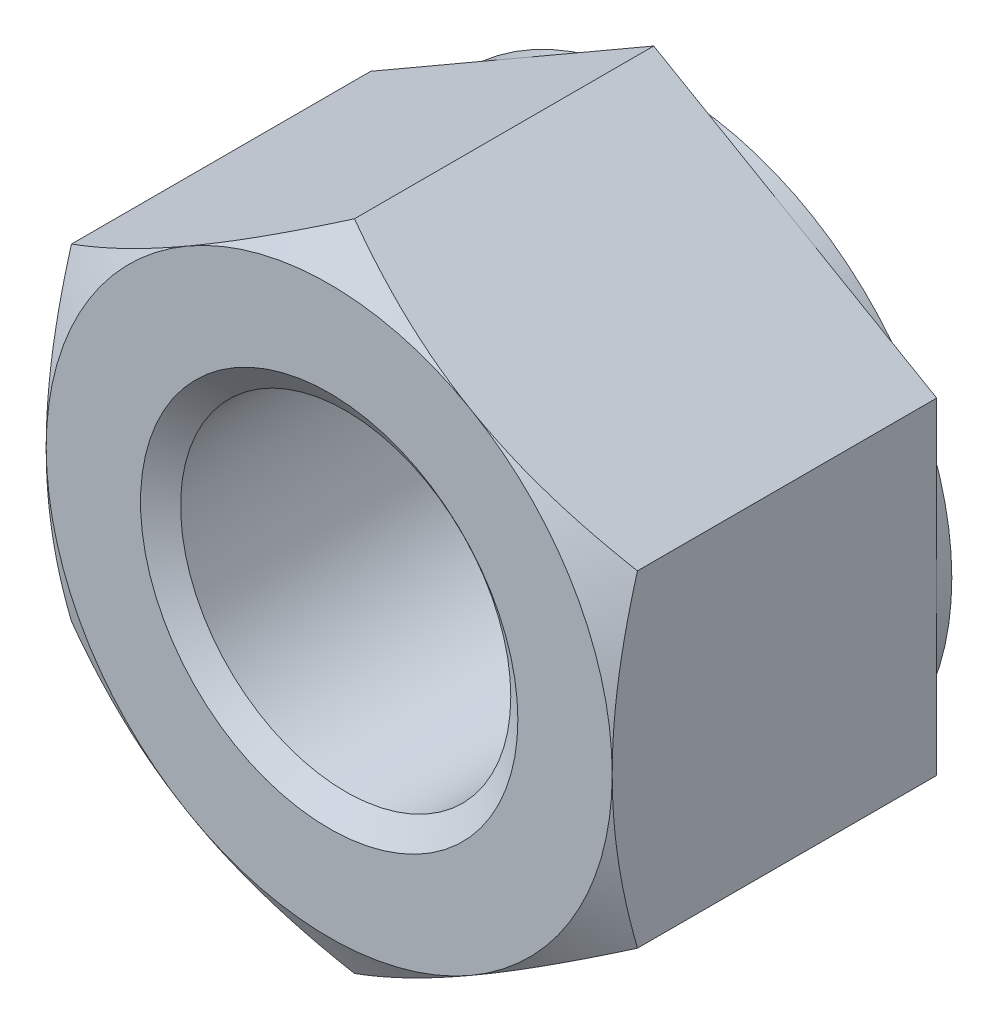
ISO-10303-21;
HEADER;
FILE_DESCRIPTION(('STEP AP214'),'2;1');
FILE_NAME('part.step','',(''),(''),'','','');
FILE_SCHEMA(('AUTOMOTIVE_DESIGN { 1 0 10303 214 1 1 1 1 }'));
ENDSEC;
DATA;
#1=APPLICATION_CONTEXT('core data for automotive mechanical design processes');
#2=APPLICATION_PROTOCOL_DEFINITION('international standard','automotive_design',2000,#1);
#3=PRODUCT_CONTEXT('',#1,'mechanical');
#4=PRODUCT('Part','Part','',(#3));
#5=PRODUCT_RELATED_PRODUCT_CATEGORY('part','',(#4));
#6=PRODUCT_DEFINITION_FORMATION('','',#4);
#7=PRODUCT_DEFINITION_CONTEXT('part definition',#1,'design');
#8=PRODUCT_DEFINITION('design','',#6,#7);
#9=PRODUCT_DEFINITION_SHAPE('','',#8);
#10=(LENGTH_UNIT() NAMED_UNIT(*) SI_UNIT(.MILLI.,.METRE.));
#11=(NAMED_UNIT(*) PLANE_ANGLE_UNIT() SI_UNIT($,.RADIAN.));
#12=(NAMED_UNIT(*) SI_UNIT($,.STERADIAN.) SOLID_ANGLE_UNIT());
#13=UNCERTAINTY_MEASURE_WITH_UNIT(LENGTH_MEASURE(1.E-05),#10,'distance_accuracy_value','');
#14=(GEOMETRIC_REPRESENTATION_CONTEXT(3) GLOBAL_UNCERTAINTY_ASSIGNED_CONTEXT((#13)) GLOBAL_UNIT_ASSIGNED_CONTEXT((#10,
#11,#12)) REPRESENTATION_CONTEXT('',''));
#15=CARTESIAN_POINT('',(0.,0.,0.));
#16=DIRECTION('',(0.,0.,1.));
#17=DIRECTION('',(1.,0.,0.));
#18=AXIS2_PLACEMENT_3D('',#15,#16,#17);
#19=CARTESIAN_POINT('',(0.,0.,-18.));
#20=DIRECTION('',(0.,0.,1.));
#21=DIRECTION('',(1.,0.,0.));
#22=AXIS2_PLACEMENT_3D('',#19,#20,#21);
#23=CYLINDRICAL_SURFACE('',#22,8.75);
#24=CARTESIAN_POINT('',(0.,0.,-0.875259422762141));
#25=DIRECTION('',(0.,0.,1.));
#26=DIRECTION('',(1.,0.,0.));
#27=AXIS2_PLACEMENT_3D('',#24,#25,#26);
#28=CIRCLE('',#27,8.75);
#29=CARTESIAN_POINT('',(8.75,0.,-0.875259422762141));
#30=VERTEX_POINT('',#29);
#31=EDGE_CURVE('E153',#30,#30,#28,.F.);
#32=ORIENTED_EDGE('',*,*,#31,.F.);
#33=EDGE_LOOP('',(#32));
#34=FACE_BOUND('',#33,.T.);
#35=CARTESIAN_POINT('',(0.,0.,-17.0993405772379));
#36=DIRECTION('',(0.,0.,-1.));
#37=DIRECTION('',(-1.,0.,0.));
#38=AXIS2_PLACEMENT_3D('',#35,#36,#37);
#39=CIRCLE('',#38,8.75);
#40=CARTESIAN_POINT('',(-8.75,0.,-17.0993405772379));
#41=VERTEX_POINT('',#40);
#42=EDGE_CURVE('E41',#41,#41,#39,.F.);
#43=ORIENTED_EDGE('',*,*,#42,.F.);
#44=EDGE_LOOP('',(#43));
#45=FACE_BOUND('',#44,.T.);
#46=ADVANCED_FACE('F36',(#34,#45),#23,.F.);
#47=CARTESIAN_POINT('',(-30.,0.,-18.));
#48=DIRECTION('',(0.,0.,1.));
#49=DIRECTION('',(1.,0.,0.));
#50=AXIS2_PLACEMENT_3D('',#47,#48,#49);
#51=PLANE('',#50);
#52=CARTESIAN_POINT('',(0.,0.,-18.));
#53=DIRECTION('',(0.,0.,1.));
#54=DIRECTION('',(1.,0.,0.));
#55=AXIS2_PLACEMENT_3D('',#52,#53,#54);
#56=CIRCLE('',#55,15.);
#57=CARTESIAN_POINT('',(15.,0.,-18.));
#58=VERTEX_POINT('',#57);
#59=EDGE_CURVE('E277',#58,#58,#56,.F.);
#60=ORIENTED_EDGE('',*,*,#59,.T.);
#61=EDGE_LOOP('',(#60));
#62=FACE_BOUND('',#61,.T.);
#63=CARTESIAN_POINT('',(0.,0.,-18.));
#64=DIRECTION('',(0.,0.,1.));
#65=DIRECTION('',(1.,0.,0.));
#66=AXIS2_PLACEMENT_3D('',#63,#64,#65);
#67=CIRCLE('',#66,10.);
#68=CARTESIAN_POINT('',(10.,0.,-18.));
#69=VERTEX_POINT('',#68);
#70=EDGE_CURVE('E297',#69,#69,#67,.F.);
#71=ORIENTED_EDGE('',*,*,#70,.F.);
#72=EDGE_LOOP('',(#71));
#73=FACE_BOUND('',#72,.T.);
#74=ADVANCED_FACE('F229',(#62,#73),#51,.F.);
#75=CARTESIAN_POINT('',(-30.,0.,0.));
#76=DIRECTION('',(0.,0.,1.));
#77=DIRECTION('',(1.,0.,0.));
#78=AXIS2_PLACEMENT_3D('',#75,#76,#77);
#79=PLANE('',#78);
#80=CARTESIAN_POINT('',(0.,0.,0.));
#81=DIRECTION('',(0.,0.,1.));
#82=DIRECTION('',(1.,0.,0.));
#83=AXIS2_PLACEMENT_3D('',#80,#81,#82);
#84=CIRCLE('',#83,15.);
#85=CARTESIAN_POINT('',(15.,0.,0.));
#86=VERTEX_POINT('',#85);
#87=CARTESIAN_POINT('',(7.50000000000002,-12.9903810567666,0.));
#88=VERTEX_POINT('',#87);
#89=EDGE_CURVE('E12',#86,#88,#84,.F.);
#90=ORIENTED_EDGE('',*,*,#89,.F.);
#91=CARTESIAN_POINT('',(0.,0.,0.));
#92=DIRECTION('',(0.,0.,1.));
#93=DIRECTION('',(1.,0.,0.));
#94=AXIS2_PLACEMENT_3D('',#91,#92,#93);
#95=CIRCLE('',#94,15.);
#96=CARTESIAN_POINT('',(7.50000000000002,12.9903810567666,0.));
#97=VERTEX_POINT('',#96);
#98=EDGE_CURVE('E145',#86,#97,#95,.T.);
#99=ORIENTED_EDGE('',*,*,#98,.T.);
#100=CARTESIAN_POINT('',(-7.50000000000002,12.9903810567666,0.));
#101=VERTEX_POINT('',#100);
#102=EDGE_CURVE('E48',#101,#97,#84,.F.);
#103=ORIENTED_EDGE('',*,*,#102,.F.);
#104=CARTESIAN_POINT('',(-15.,0.,0.));
#105=VERTEX_POINT('',#104);
#106=EDGE_CURVE('E358',#105,#101,#84,.F.);
#107=ORIENTED_EDGE('',*,*,#106,.F.);
#108=CARTESIAN_POINT('',(-7.50000000000002,-12.9903810567666,0.));
#109=VERTEX_POINT('',#108);
#110=EDGE_CURVE('E360',#109,#105,#84,.F.);
#111=ORIENTED_EDGE('',*,*,#110,.F.);
#112=EDGE_CURVE('E46',#88,#109,#84,.F.);
#113=ORIENTED_EDGE('',*,*,#112,.F.);
#114=EDGE_LOOP('',(#90,#99,#103,#107,#111,#113));
#115=FACE_BOUND('',#114,.T.);
#116=CARTESIAN_POINT('',(0.,0.,0.));
#117=DIRECTION('',(0.,0.,1.));
#118=DIRECTION('',(1.,0.,0.));
#119=AXIS2_PLACEMENT_3D('',#116,#117,#118);
#120=CIRCLE('',#119,10.);
#121=CARTESIAN_POINT('',(10.,0.,0.));
#122=VERTEX_POINT('',#121);
#123=EDGE_CURVE('E296',#122,#122,#120,.T.);
#124=ORIENTED_EDGE('',*,*,#123,.F.);
#125=EDGE_LOOP('',(#124));
#126=FACE_BOUND('',#125,.T.);
#127=ADVANCED_FACE('F155',(#115,#126),#79,.T.);
#128=CARTESIAN_POINT('',(0.,17.3205080756888,-18.));
#129=DIRECTION('',(-0.500000000000001,0.866025403784438,0.));
#130=DIRECTION('',(-0.866025403784438,-0.500000000000001,0.));
#131=AXIS2_PLACEMENT_3D('',#128,#129,#130);
#132=PLANE('',#131);
#133=DIRECTION('',(0.,0.,1.));
#134=VECTOR('',#133,1.);
#135=CARTESIAN_POINT('',(-15.,8.66025403784437,-18.));
#136=LINE('',#135,#134);
#137=CARTESIAN_POINT('',(-15.,8.66025403784437,-17.2));
#138=VERTEX_POINT('',#137);
#139=CARTESIAN_POINT('',(-15.,8.66025403784437,-1.33974596215562));
#140=VERTEX_POINT('',#139);
#141=EDGE_CURVE('E286',#138,#140,#136,.T.);
#142=ORIENTED_EDGE('',*,*,#141,.T.);
#143=CARTESIAN_POINT('',(-15.0002,8.66013856779054,-1.33981262948894));
#144=CARTESIAN_POINT('',(-14.6705058957662,8.85048754762015,-1.22992178974394));
#145=CARTESIAN_POINT('',(-14.3395258073717,9.04157899075113,-1.12501758932861));
#146=CARTESIAN_POINT('',(-13.674911559644,9.42529420558398,-0.926568581943102));
#147=CARTESIAN_POINT('',(-13.3412765656162,9.61791845919701,-0.833027511049492));
#148=CARTESIAN_POINT('',(-12.6707077197453,10.0050715628708,-0.658562147609859));
#149=CARTESIAN_POINT('',(-12.333767999973,10.199603800782,-0.577667706602186));
#150=CARTESIAN_POINT('',(-11.6575472373606,10.5900200401078,-0.430232643422043));
#151=CARTESIAN_POINT('',(-11.3182663292305,10.7859039637477,-0.363691202381326));
#152=CARTESIAN_POINT('',(-10.6460568576327,11.1740042831265,-0.247792374696308));
#153=CARTESIAN_POINT('',(-10.3131781995737,11.3661918659643,-0.198051383436665));
#154=CARTESIAN_POINT('',(-9.64589556983831,11.7514476718676,-0.114646749003606));
#155=CARTESIAN_POINT('',(-9.31149156892751,11.9445159118115,-0.0809834152900859));
#156=CARTESIAN_POINT('',(-8.64212181582285,12.3309767189539,-0.0305840757080833));
#157=CARTESIAN_POINT('',(-8.30715720719665,12.5243686259132,-0.0138279549580483));
#158=CARTESIAN_POINT('',(-7.636918786609,12.9113309584608,0.00239660617302434));
#159=CARTESIAN_POINT('',(-7.30164498452176,13.1049013783481,0.0018655807275811));
#160=CARTESIAN_POINT('',(-6.6748531126878,13.4667798342773,-0.0152766129981669));
#161=CARTESIAN_POINT('',(-6.38329037496757,13.6351136593857,-0.0297968460490132));
#162=CARTESIAN_POINT('',(-5.80083556199352,13.9713941024471,-0.0716371404224109));
#163=CARTESIAN_POINT('',(-5.50994353564011,14.1393406921673,-0.0989581071094768));
#164=CARTESIAN_POINT('',(-4.92898814775338,14.4747554417509,-0.165923511998906));
#165=CARTESIAN_POINT('',(-4.63892567103482,14.6422230907662,-0.205578128270663));
#166=CARTESIAN_POINT('',(-4.06016058267397,14.9763732703289,-0.296515103017905));
#167=CARTESIAN_POINT('',(-3.77145806484047,15.1430557467157,-0.347798251969261));
#168=CARTESIAN_POINT('',(-2.89508556123959,15.6490296475801,-0.520386864747112));
#169=CARTESIAN_POINT('',(-2.30995340076274,15.9868558579429,-0.658901178256936));
#170=CARTESIAN_POINT('',(-1.14841408999664,16.6574708916881,-0.973271968475219));
#171=CARTESIAN_POINT('',(-0.571992068234585,16.9902683011192,-1.14905461461788));
#172=CARTESIAN_POINT('',(0.000200000000000169,17.3206235457426,-1.33981262948895));
#173=B_SPLINE_CURVE_WITH_KNOTS('',3,(#143,#144,#145,#146,#147,#148,#149,#150,#151,#152,#153,
#154,#155,#156,#157,#158,#159,#160,#161,#162,#163,#164,#165,#166,#167,#168,#169,#170,#171,#172),
.UNSPECIFIED.,.F.,.F.,(4,2,2,2,2,2,2,2,2,2,2,2,2,2,4),(0.,1.18875411504163,2.37789802800057,
3.56980778300395,4.76164951910136,5.92407379683758,7.08652044780812,8.24758247406078,
9.40860862348377,10.4193068498566,11.4300765712312,12.4416826308653,13.4533574773408,
15.5211962051185,17.5849760846241),.UNSPECIFIED.);
#174=EDGE_CURVE('E139',#140,#101,#173,.T.);
#175=ORIENTED_EDGE('',*,*,#174,.T.);
#176=CARTESIAN_POINT('',(0.,17.3205080756888,-1.33974596215562));
#177=VERTEX_POINT('',#176);
#178=EDGE_CURVE('E167',#101,#177,#173,.T.);
#179=ORIENTED_EDGE('',*,*,#178,.T.);
#180=DIRECTION('',(0.,0.,1.));
#181=VECTOR('',#180,1.);
#182=CARTESIAN_POINT('',(0.,17.3205080756888,-18.));
#183=LINE('',#182,#181);
#184=CARTESIAN_POINT('',(0.,17.3205080756888,-17.2));
#185=VERTEX_POINT('',#184);
#186=EDGE_CURVE('E274',#185,#177,#183,.T.);
#187=ORIENTED_EDGE('',*,*,#186,.F.);
#188=DIRECTION('',(-0.866025403784438,-0.500000000000001,0.));
#189=VECTOR('',#188,1.);
#190=CARTESIAN_POINT('',(0.,17.3205080756888,-17.2));
#191=LINE('',#190,#189);
#192=CARTESIAN_POINT('',(-7.50000000000002,12.9903810567666,-17.2));
#193=VERTEX_POINT('',#192);
#194=EDGE_CURVE('E262',#185,#193,#191,.T.);
#195=ORIENTED_EDGE('',*,*,#194,.T.);
#196=EDGE_CURVE('E258',#193,#138,#191,.T.);
#197=ORIENTED_EDGE('',*,*,#196,.T.);
#198=EDGE_LOOP('',(#142,#175,#179,#187,#195,#197));
#199=FACE_BOUND('',#198,.T.);
#200=ADVANCED_FACE('F38',(#199),#132,.T.);
#201=CARTESIAN_POINT('',(15.,8.66025403784437,-18.));
#202=DIRECTION('',(0.500000000000001,0.866025403784438,0.));
#203=DIRECTION('',(-0.866025403784438,0.500000000000001,0.));
#204=AXIS2_PLACEMENT_3D('',#201,#202,#203);
#205=PLANE('',#204);
#206=ORIENTED_EDGE('',*,*,#186,.T.);
#207=CARTESIAN_POINT('',(-0.000200000000000716,17.3206235457426,-1.33981262948895));
#208=CARTESIAN_POINT('',(0.329494104233799,17.130274565913,-1.22992178974395));
#209=CARTESIAN_POINT('',(0.660474192628299,16.939183122782,-1.12501758932862));
#210=CARTESIAN_POINT('',(1.32508844035602,16.5554679079492,-0.926568581943109));
#211=CARTESIAN_POINT('',(1.6587234343838,16.3628436543362,-0.833027511049498));
#212=CARTESIAN_POINT('',(2.32929228025473,15.9756905506624,-0.658562147609865));
#213=CARTESIAN_POINT('',(2.66623200002701,15.7811583127512,-0.577667706602193));
#214=CARTESIAN_POINT('',(3.34245276263938,15.3907420734253,-0.430232643422049));
#215=CARTESIAN_POINT('',(3.68173367076951,15.1948581497855,-0.36369120238133));
#216=CARTESIAN_POINT('',(4.35394314236732,14.8067578304067,-0.247792374696311));
#217=CARTESIAN_POINT('',(4.68682180042634,14.6145702475688,-0.198051383436668));
#218=CARTESIAN_POINT('',(5.3541044301617,14.2293144416656,-0.114646749003608));
#219=CARTESIAN_POINT('',(5.68850843107249,14.0362462017216,-0.0809834152900865));
#220=CARTESIAN_POINT('',(6.35787818417715,13.6497853945792,-0.0305840757080828));
#221=CARTESIAN_POINT('',(6.69284279280335,13.4563934876199,-0.0138279549580478));
#222=CARTESIAN_POINT('',(7.36308121339101,13.0694311550724,0.00239660617302488));
#223=CARTESIAN_POINT('',(7.69835501547825,12.8758607351851,0.00186558072758167));
#224=CARTESIAN_POINT('',(8.32514688731221,12.5139822792559,-0.015276612998165));
#225=CARTESIAN_POINT('',(8.61670962503243,12.3456484541475,-0.0297968460490101));
#226=CARTESIAN_POINT('',(9.19916443800648,12.0093680110861,-0.0716371404224066));
#227=CARTESIAN_POINT('',(9.49005646435989,11.8414214213658,-0.0989581071094725));
#228=CARTESIAN_POINT('',(10.0710118522466,11.5060066717823,-0.165923511998902));
#229=CARTESIAN_POINT('',(10.3610743289652,11.338539022767,-0.205578128270659));
#230=CARTESIAN_POINT('',(10.939839417326,11.0043888432043,-0.296515103017901));
#231=CARTESIAN_POINT('',(11.2285419351595,10.8377063668174,-0.347798251969255));
#232=CARTESIAN_POINT('',(12.1049144387604,10.3317324659531,-0.520386864747105));
#233=CARTESIAN_POINT('',(12.6900465992373,9.99390625559024,-0.658901178256929));
#234=CARTESIAN_POINT('',(13.8515859100034,9.32329122184509,-0.973271968475214));
#235=CARTESIAN_POINT('',(14.4280079317654,8.99049381241394,-1.14905461461788));
#236=CARTESIAN_POINT('',(15.0002,8.66013856779053,-1.33981262948894));
#237=B_SPLINE_CURVE_WITH_KNOTS('',3,(#207,#208,#209,#210,#211,#212,#213,#214,#215,#216,#217,
#218,#219,#220,#221,#222,#223,#224,#225,#226,#227,#228,#229,#230,#231,#232,#233,#234,#235,#236),
.UNSPECIFIED.,.F.,.F.,(4,2,2,2,2,2,2,2,2,2,2,2,2,2,4),(0.,1.18875411504163,2.37789802800057,
3.56980778300395,4.76164951910136,5.92407379683759,7.08652044780812,8.24758247406079,
9.40860862348377,10.4193068498566,11.4300765712312,12.4416826308653,13.4533574773408,
15.5211962051185,17.5849760846241),.UNSPECIFIED.);
#238=EDGE_CURVE('E163',#177,#97,#237,.T.);
#239=ORIENTED_EDGE('',*,*,#238,.T.);
#240=CARTESIAN_POINT('',(15.,8.66025403784441,-1.33974596215562));
#241=VERTEX_POINT('',#240);
#242=EDGE_CURVE('E148',#97,#241,#237,.T.);
#243=ORIENTED_EDGE('',*,*,#242,.T.);
#244=DIRECTION('',(0.,0.,1.));
#245=VECTOR('',#244,1.);
#246=CARTESIAN_POINT('',(15.,8.66025403784437,-18.));
#247=LINE('',#246,#245);
#248=CARTESIAN_POINT('',(15.,8.66025403784437,-17.2));
#249=VERTEX_POINT('',#248);
#250=EDGE_CURVE('E162',#249,#241,#247,.T.);
#251=ORIENTED_EDGE('',*,*,#250,.F.);
#252=DIRECTION('',(-0.866025403784438,0.500000000000001,0.));
#253=VECTOR('',#252,1.);
#254=CARTESIAN_POINT('',(15.,8.66025403784437,-17.2));
#255=LINE('',#254,#253);
#256=CARTESIAN_POINT('',(7.50000000000001,12.9903810567666,-17.2));
#257=VERTEX_POINT('',#256);
#258=EDGE_CURVE('E270',#249,#257,#255,.T.);
#259=ORIENTED_EDGE('',*,*,#258,.T.);
#260=EDGE_CURVE('E266',#257,#185,#255,.T.);
#261=ORIENTED_EDGE('',*,*,#260,.T.);
#262=EDGE_LOOP('',(#206,#239,#243,#251,#259,#261));
#263=FACE_BOUND('',#262,.T.);
#264=ADVANCED_FACE('F242',(#263),#205,.T.);
#265=CARTESIAN_POINT('',(15.,8.66025403784437,-18.));
#266=DIRECTION('',(-1.,0.,0.));
#267=DIRECTION('',(0.,0.,1.));
#268=AXIS2_PLACEMENT_3D('',#265,#266,#267);
#269=PLANE('',#268);
#270=CARTESIAN_POINT('',(15.,-22.9682699623457,-7.17790057965227));
#271=CARTESIAN_POINT('',(15.,-22.6389897831074,-7.01873142404233));
#272=CARTESIAN_POINT('',(15.,-22.3093116021534,-6.86038603901538));
#273=CARTESIAN_POINT('',(15.,-21.6490751536497,-6.54553189598666));
#274=CARTESIAN_POINT('',(15.,-21.3185168764807,-6.38902315816101));
#275=CARTESIAN_POINT('',(15.,-20.3252989549744,-5.92249019185913));
#276=CARTESIAN_POINT('',(15.,-19.6612032697286,-5.61551110607191));
#277=CARTESIAN_POINT('',(15.,-18.3246226043912,-5.00989859467258));
#278=CARTESIAN_POINT('',(15.,-17.6521113636296,-4.71132298088698));
#279=CARTESIAN_POINT('',(15.,-16.3015621477647,-4.12699119584707));
#280=CARTESIAN_POINT('',(15.,-15.6235244629268,-3.84123435637443));
#281=CARTESIAN_POINT('',(15.,-14.2524269634776,-3.28256457383085));
#282=CARTESIAN_POINT('',(15.,-13.5592849190571,-3.00985238384249));
#283=CARTESIAN_POINT('',(15.,-12.1648203164479,-2.48578579805704));
#284=CARTESIAN_POINT('',(15.,-11.4634968579634,-2.23443377846729));
#285=CARTESIAN_POINT('',(15.,-10.0530172161698,-1.75984469264095));
#286=CARTESIAN_POINT('',(15.,-9.34388131081086,-1.53654785403614));
#287=CARTESIAN_POINT('',(15.,-7.91545988349901,-1.12531011422904));
#288=CARTESIAN_POINT('',(15.,-7.19617764885278,-0.937358032225481));
#289=CARTESIAN_POINT('',(15.,-6.10950776052104,-0.68881881982808));
#290=CARTESIAN_POINT('',(15.,-5.74591626101914,-0.611524520059371));
#291=CARTESIAN_POINT('',(15.,-5.01631310495844,-0.469286024803709));
#292=CARTESIAN_POINT('',(15.,-4.65030150125062,-0.404341560532858));
#293=CARTESIAN_POINT('',(15.,-3.91609659669047,-0.287952997760446));
#294=CARTESIAN_POINT('',(15.,-3.54790312013281,-0.236510002059407));
#295=CARTESIAN_POINT('',(15.,-2.80977894214556,-0.148161213469115));
#296=CARTESIAN_POINT('',(15.,-2.43984831081849,-0.111254838973176));
#297=CARTESIAN_POINT('',(15.,-1.70111543119015,-0.0529692351511495));
#298=CARTESIAN_POINT('',(15.,-1.3323208752846,-0.0314931455080655));
#299=CARTESIAN_POINT('',(15.,-0.594154033471582,-0.00418216853329556));
#300=CARTESIAN_POINT('',(15.,-0.224781755128986,0.00165292191908621));
#301=CARTESIAN_POINT('',(15.,0.513772761739784,-0.00245653426590893));
#302=CARTESIAN_POINT('',(15.,0.882955024506784,-0.0123966523921697));
#303=CARTESIAN_POINT('',(15.,1.62057875039961,-0.0478095011464145));
#304=CARTESIAN_POINT('',(15.,1.98902017560892,-0.0732830074530984));
#305=CARTESIAN_POINT('',(15.,2.8820087859798,-0.153315988744048));
#306=CARTESIAN_POINT('',(15.,3.40586988037196,-0.215658229469292));
#307=CARTESIAN_POINT('',(15.,4.44957771463113,-0.368284321561815));
#308=CARTESIAN_POINT('',(15.,4.96942331940065,-0.458575797224096));
#309=CARTESIAN_POINT('',(15.,6.00467140043031,-0.663898119259711));
#310=CARTESIAN_POINT('',(15.,6.52006919294574,-0.778952357645808));
#311=CARTESIAN_POINT('',(15.,7.54556200724785,-1.030289356594));
#312=CARTESIAN_POINT('',(15.,8.0556575236537,-1.1665701177488));
#313=CARTESIAN_POINT('',(15.,9.08310964327574,-1.46066370490327));
#314=CARTESIAN_POINT('',(15.,9.60033774272843,-1.61892244443969));
#315=CARTESIAN_POINT('',(15.,10.6293258234342,-1.95107200986663));
#316=CARTESIAN_POINT('',(15.,11.1410893076101,-2.12495205365791));
#317=CARTESIAN_POINT('',(15.,12.1570993841288,-2.48477464183465));
#318=CARTESIAN_POINT('',(15.,12.6613720729254,-2.67064378150476));
#319=CARTESIAN_POINT('',(15.,13.4147912594165,-2.95756327132974));
#320=CARTESIAN_POINT('',(15.,13.6654863245841,-3.05457748949892));
#321=CARTESIAN_POINT('',(15.,14.1659013187592,-3.2510732293356));
#322=CARTESIAN_POINT('',(15.,14.4156212703266,-3.35055469352571));
#323=CARTESIAN_POINT('',(15.,14.6648887120004,-3.45115877453161));
#324=B_SPLINE_CURVE_WITH_KNOTS('',3,(#270,#271,#272,#273,#274,#275,#276,#277,#278,#279,#280,
#281,#282,#283,#284,#285,#286,#287,#288,#289,#290,#291,#292,#293,#294,#295,#296,#297,#298,#299,
#300,#301,#302,#303,#304,#305,#306,#307,#308,#309,#310,#311,#312,#313,#314,#315,#316,#317,#318,
#319,#320,#321,#322,#323),.UNSPECIFIED.,.F.,.F.,(4,2,2,2,2,2,2,2,2,2,2,2,2,2,2,2,2,2,2,2,2,2,2,
2,2,2,4),(0.,1.09719534304745,2.19440272785255,4.38917437060373,6.59650580508102,
8.80372204153741,11.0380360432621,13.2725982762572,15.502315932016,17.7313270580364,
18.8463006788364,19.9612500303848,21.0762904227212,22.1912861980293,23.2992201789375,
24.4071397716721,25.5147483975893,26.6224123378252,28.2042036031028,29.7864267473646,
31.3701511423085,32.9537264503146,34.5761185954281,36.1973994161361,37.8095545791833,
38.615979427752,39.4223855073193),.UNSPECIFIED.);
#325=CARTESIAN_POINT('',(15.,-8.66025403784442,-1.33974596215562));
#326=VERTEX_POINT('',#325);
#327=EDGE_CURVE('E128',#326,#86,#324,.T.);
#328=ORIENTED_EDGE('',*,*,#327,.F.);
#329=DIRECTION('',(0.,0.,1.));
#330=VECTOR('',#329,1.);
#331=CARTESIAN_POINT('',(15.,-8.66025403784441,-18.));
#332=LINE('',#331,#330);
#333=CARTESIAN_POINT('',(15.,-8.66025403784441,-17.2));
#334=VERTEX_POINT('',#333);
#335=EDGE_CURVE('E279',#334,#326,#332,.T.);
#336=ORIENTED_EDGE('',*,*,#335,.F.);
#337=DIRECTION('',(0.,-1.,0.));
#338=VECTOR('',#337,1.);
#339=CARTESIAN_POINT('',(15.,8.66025403784437,-17.2));
#340=LINE('',#339,#338);
#341=CARTESIAN_POINT('',(15.,0.,-17.2));
#342=VERTEX_POINT('',#341);
#343=EDGE_CURVE('E271',#342,#334,#340,.T.);
#344=ORIENTED_EDGE('',*,*,#343,.F.);
#345=EDGE_CURVE('E273',#249,#342,#340,.T.);
#346=ORIENTED_EDGE('',*,*,#345,.F.);
#347=ORIENTED_EDGE('',*,*,#250,.T.);
#348=EDGE_CURVE('E141',#86,#241,#324,.T.);
#349=ORIENTED_EDGE('',*,*,#348,.F.);
#350=EDGE_LOOP('',(#328,#336,#344,#346,#347,#349));
#351=FACE_BOUND('',#350,.T.);
#352=ADVANCED_FACE('F159',(#351),#269,.F.);
#353=CARTESIAN_POINT('',(0.,-17.3205080756888,-18.));
#354=DIRECTION('',(0.500000000000001,-0.866025403784438,0.));
#355=DIRECTION('',(0.866025403784438,0.500000000000001,0.));
#356=AXIS2_PLACEMENT_3D('',#353,#354,#355);
#357=PLANE('',#356);
#358=ORIENTED_EDGE('',*,*,#335,.T.);
#359=CARTESIAN_POINT('',(15.0002,-8.66013856779057,-1.33981262948895));
#360=CARTESIAN_POINT('',(14.6705058957662,-8.85048754762019,-1.22992178974395));
#361=CARTESIAN_POINT('',(14.3395258073717,-9.04157899075116,-1.12501758932862));
#362=CARTESIAN_POINT('',(13.674911559644,-9.42529420558402,-0.926568581943113));
#363=CARTESIAN_POINT('',(13.3412765656162,-9.61791845919704,-0.833027511049504));
#364=CARTESIAN_POINT('',(12.6707077197453,-10.0050715628708,-0.658562147609871));
#365=CARTESIAN_POINT('',(12.333767999973,-10.199603800782,-0.577667706602198));
#366=CARTESIAN_POINT('',(11.6575472373606,-10.5900200401079,-0.430232643422054));
#367=CARTESIAN_POINT('',(11.3182663292305,-10.7859039637477,-0.363691202381338));
#368=CARTESIAN_POINT('',(10.6460568576327,-11.1740042831265,-0.247792374696322));
#369=CARTESIAN_POINT('',(10.3131781995737,-11.3661918659644,-0.198051383436679));
#370=CARTESIAN_POINT('',(9.6458955698383,-11.7514476718676,-0.114646749003621));
#371=CARTESIAN_POINT('',(9.3114915689275,-11.9445159118116,-0.080983415290101));
#372=CARTESIAN_POINT('',(8.64212181582284,-12.330976718954,-0.0305840757080993));
#373=CARTESIAN_POINT('',(8.30715720719664,-12.5243686259133,-0.0138279549580646));
#374=CARTESIAN_POINT('',(7.63691878660899,-12.9113309584608,0.00239660617300668));
#375=CARTESIAN_POINT('',(7.30164498452175,-13.1049013783481,0.00186558072756239));
#376=CARTESIAN_POINT('',(6.67485311268779,-13.4667798342773,-0.0152766129981866));
#377=CARTESIAN_POINT('',(6.38329037496757,-13.6351136593857,-0.029796846049033));
#378=CARTESIAN_POINT('',(5.80083556199351,-13.9713941024471,-0.0716371404224307));
#379=CARTESIAN_POINT('',(5.5099435356401,-14.1393406921674,-0.0989581071094967));
#380=CARTESIAN_POINT('',(4.92898814775337,-14.4747554417509,-0.165923511998927));
#381=CARTESIAN_POINT('',(4.63892567103481,-14.6422230907662,-0.205578128270684));
#382=CARTESIAN_POINT('',(4.06016058267396,-14.9763732703289,-0.296515103017927));
#383=CARTESIAN_POINT('',(3.77145806484046,-15.1430557467158,-0.347798251969283));
#384=CARTESIAN_POINT('',(2.89508556123959,-15.6490296475801,-0.520386864747134));
#385=CARTESIAN_POINT('',(2.30995340076274,-15.986855857943,-0.658901178256957));
#386=CARTESIAN_POINT('',(1.14841408999663,-16.6574708916881,-0.973271968475242));
#387=CARTESIAN_POINT('',(0.571992068234582,-16.9902683011193,-1.14905461461791));
#388=CARTESIAN_POINT('',(-0.000200000000001088,-17.3206235457427,-1.33981262948897));
#389=B_SPLINE_CURVE_WITH_KNOTS('',3,(#359,#360,#361,#362,#363,#364,#365,#366,#367,#368,#369,
#370,#371,#372,#373,#374,#375,#376,#377,#378,#379,#380,#381,#382,#383,#384,#385,#386,#387,#388),
.UNSPECIFIED.,.F.,.F.,(4,2,2,2,2,2,2,2,2,2,2,2,2,2,4),(0.,1.18875411504163,2.37789802800057,
3.56980778300395,4.76164951910137,5.92407379683759,7.08652044780813,8.24758247406079,
9.40860862348378,10.4193068498566,11.4300765712312,12.4416826308653,13.4533574773408,
15.5211962051185,17.5849760846241),.UNSPECIFIED.);
#390=EDGE_CURVE('E134',#326,#88,#389,.T.);
#391=ORIENTED_EDGE('',*,*,#390,.T.);
#392=CARTESIAN_POINT('',(0.,-17.3205080756888,-1.33974596215562));
#393=VERTEX_POINT('',#392);
#394=EDGE_CURVE('E55',#88,#393,#389,.T.);
#395=ORIENTED_EDGE('',*,*,#394,.T.);
#396=DIRECTION('',(0.,0.,1.));
#397=VECTOR('',#396,1.);
#398=CARTESIAN_POINT('',(0.,-17.3205080756888,-18.));
#399=LINE('',#398,#397);
#400=CARTESIAN_POINT('',(0.,-17.3205080756888,-17.2));
#401=VERTEX_POINT('',#400);
#402=EDGE_CURVE('E281',#401,#393,#399,.T.);
#403=ORIENTED_EDGE('',*,*,#402,.F.);
#404=DIRECTION('',(0.866025403784438,0.500000000000001,0.));
#405=VECTOR('',#404,1.);
#406=CARTESIAN_POINT('',(0.,-17.3205080756888,-17.2));
#407=LINE('',#406,#405);
#408=CARTESIAN_POINT('',(7.50000000000004,-12.9903810567666,-17.2));
#409=VERTEX_POINT('',#408);
#410=EDGE_CURVE('E263',#401,#409,#407,.T.);
#411=ORIENTED_EDGE('',*,*,#410,.T.);
#412=EDGE_CURVE('E267',#409,#334,#407,.T.);
#413=ORIENTED_EDGE('',*,*,#412,.T.);
#414=EDGE_LOOP('',(#358,#391,#395,#403,#411,#413));
#415=FACE_BOUND('',#414,.T.);
#416=ADVANCED_FACE('F215',(#415),#357,.T.);
#417=CARTESIAN_POINT('',(-15.,-8.66025403784441,-18.));
#418=DIRECTION('',(-0.500000000000001,-0.866025403784438,0.));
#419=DIRECTION('',(0.866025403784438,-0.500000000000001,0.));
#420=AXIS2_PLACEMENT_3D('',#417,#418,#419);
#421=PLANE('',#420);
#422=ORIENTED_EDGE('',*,*,#402,.T.);
#423=CARTESIAN_POINT('',(0.0002,-17.3206235457427,-1.33981262948897));
#424=CARTESIAN_POINT('',(-0.329494104233801,-17.130274565913,-1.22992178974397));
#425=CARTESIAN_POINT('',(-0.660474192628302,-16.9391831227821,-1.12501758932864));
#426=CARTESIAN_POINT('',(-1.32508844035602,-16.5554679079492,-0.926568581943131));
#427=CARTESIAN_POINT('',(-1.65872343438381,-16.3628436543362,-0.833027511049521));
#428=CARTESIAN_POINT('',(-2.32929228025473,-15.9756905506624,-0.658562147609886));
#429=CARTESIAN_POINT('',(-2.66623200002702,-15.7811583127512,-0.577667706602212));
#430=CARTESIAN_POINT('',(-3.34245276263939,-15.3907420734254,-0.430232643422067));
#431=CARTESIAN_POINT('',(-3.68173367076952,-15.1948581497855,-0.36369120238135));
#432=CARTESIAN_POINT('',(-4.35394314236733,-14.8067578304067,-0.247792374696331));
#433=CARTESIAN_POINT('',(-4.68682180042635,-14.6145702475689,-0.198051383436687));
#434=CARTESIAN_POINT('',(-5.35410443016171,-14.2293144416656,-0.114646749003627));
#435=CARTESIAN_POINT('',(-5.68850843107251,-14.0362462017216,-0.080983415290106));
#436=CARTESIAN_POINT('',(-6.35787818417717,-13.6497853945793,-0.0305840757081023));
#437=CARTESIAN_POINT('',(-6.69284279280337,-13.4563934876199,-0.0138279549580668));
#438=CARTESIAN_POINT('',(-7.36308121339103,-13.0694311550724,0.00239660617300584));
#439=CARTESIAN_POINT('',(-7.69835501547827,-12.8758607351851,0.0018655807275622));
#440=CARTESIAN_POINT('',(-8.32514688731223,-12.5139822792559,-0.0152766129981846));
#441=CARTESIAN_POINT('',(-8.61670962503245,-12.3456484541475,-0.0297968460490295));
#442=CARTESIAN_POINT('',(-9.1991644380065,-12.0093680110861,-0.0716371404224256));
#443=CARTESIAN_POINT('',(-9.49005646435991,-11.8414214213659,-0.0989581071094914));
#444=CARTESIAN_POINT('',(-10.0710118522466,-11.5060066717823,-0.16592351199892));
#445=CARTESIAN_POINT('',(-10.3610743289652,-11.338539022767,-0.205578128270677));
#446=CARTESIAN_POINT('',(-10.939839417326,-11.0043888432043,-0.296515103017917));
#447=CARTESIAN_POINT('',(-11.2285419351595,-10.8377063668174,-0.347798251969272));
#448=CARTESIAN_POINT('',(-12.1049144387604,-10.3317324659531,-0.52038686474712));
#449=CARTESIAN_POINT('',(-12.6900465992373,-9.99390625559027,-0.658901178256943));
#450=CARTESIAN_POINT('',(-13.8515859100034,-9.32329122184512,-0.973271968475224));
#451=CARTESIAN_POINT('',(-14.4280079317654,-8.99049381241398,-1.14905461461789));
#452=CARTESIAN_POINT('',(-15.0002,-8.66013856779057,-1.33981262948895));
#453=B_SPLINE_CURVE_WITH_KNOTS('',3,(#423,#424,#425,#426,#427,#428,#429,#430,#431,#432,#433,
#434,#435,#436,#437,#438,#439,#440,#441,#442,#443,#444,#445,#446,#447,#448,#449,#450,#451,#452),
.UNSPECIFIED.,.F.,.F.,(4,2,2,2,2,2,2,2,2,2,2,2,2,2,4),(0.,1.18875411504163,2.37789802800058,
3.56980778300396,4.76164951910137,5.92407379683761,7.08652044780814,8.24758247406081,
9.4086086234838,10.4193068498567,11.4300765712312,12.4416826308653,13.4533574773408,
15.5211962051185,17.5849760846241),.UNSPECIFIED.);
#454=EDGE_CURVE('E209',#393,#109,#453,.T.);
#455=ORIENTED_EDGE('',*,*,#454,.T.);
#456=CARTESIAN_POINT('',(-15.,-8.66025403784441,-1.33974596215562));
#457=VERTEX_POINT('',#456);
#458=EDGE_CURVE('E62',#109,#457,#453,.T.);
#459=ORIENTED_EDGE('',*,*,#458,.T.);
#460=DIRECTION('',(0.,0.,1.));
#461=VECTOR('',#460,1.);
#462=CARTESIAN_POINT('',(-15.,-8.66025403784441,-18.));
#463=LINE('',#462,#461);
#464=CARTESIAN_POINT('',(-15.,-8.66025403784441,-17.2));
#465=VERTEX_POINT('',#464);
#466=EDGE_CURVE('E284',#465,#457,#463,.T.);
#467=ORIENTED_EDGE('',*,*,#466,.F.);
#468=DIRECTION('',(0.866025403784438,-0.500000000000001,0.));
#469=VECTOR('',#468,1.);
#470=CARTESIAN_POINT('',(-15.,-8.66025403784441,-17.2));
#471=LINE('',#470,#469);
#472=CARTESIAN_POINT('',(-7.50000000000004,-12.9903810567666,-17.2));
#473=VERTEX_POINT('',#472);
#474=EDGE_CURVE('E253',#465,#473,#471,.T.);
#475=ORIENTED_EDGE('',*,*,#474,.T.);
#476=EDGE_CURVE('E259',#473,#401,#471,.T.);
#477=ORIENTED_EDGE('',*,*,#476,.T.);
#478=EDGE_LOOP('',(#422,#455,#459,#467,#475,#477));
#479=FACE_BOUND('',#478,.T.);
#480=ADVANCED_FACE('F211',(#479),#421,.T.);
#481=CARTESIAN_POINT('',(-15.,8.66025403784437,-18.));
#482=DIRECTION('',(-1.,0.,0.));
#483=DIRECTION('',(0.,0.,1.));
#484=AXIS2_PLACEMENT_3D('',#481,#482,#483);
#485=PLANE('',#484);
#486=ORIENTED_EDGE('',*,*,#466,.T.);
#487=CARTESIAN_POINT('',(-15.,-22.9682699623457,-7.17790057965227));
#488=CARTESIAN_POINT('',(-15.,-22.6389897831074,-7.01873142404233));
#489=CARTESIAN_POINT('',(-15.,-22.3093116021534,-6.86038603901538));
#490=CARTESIAN_POINT('',(-15.,-21.6490751536497,-6.54553189598666));
#491=CARTESIAN_POINT('',(-15.,-21.3185168764807,-6.38902315816101));
#492=CARTESIAN_POINT('',(-15.,-20.3252989549744,-5.92249019185913));
#493=CARTESIAN_POINT('',(-15.,-19.6612032697286,-5.61551110607191));
#494=CARTESIAN_POINT('',(-15.,-18.3246226043912,-5.00989859467258));
#495=CARTESIAN_POINT('',(-15.,-17.6521113636296,-4.71132298088698));
#496=CARTESIAN_POINT('',(-15.,-16.3015621477647,-4.12699119584707));
#497=CARTESIAN_POINT('',(-15.,-15.6235244629268,-3.84123435637443));
#498=CARTESIAN_POINT('',(-15.,-14.2524269634776,-3.28256457383085));
#499=CARTESIAN_POINT('',(-15.,-13.5592849190571,-3.00985238384249));
#500=CARTESIAN_POINT('',(-15.,-12.1648203164479,-2.48578579805704));
#501=CARTESIAN_POINT('',(-15.,-11.4634968579634,-2.23443377846729));
#502=CARTESIAN_POINT('',(-15.,-10.0530172161698,-1.75984469264095));
#503=CARTESIAN_POINT('',(-15.,-9.34388131081086,-1.53654785403614));
#504=CARTESIAN_POINT('',(-15.,-7.91545988349901,-1.12531011422904));
#505=CARTESIAN_POINT('',(-15.,-7.19617764885278,-0.937358032225481));
#506=CARTESIAN_POINT('',(-15.,-6.10950776052104,-0.68881881982808));
#507=CARTESIAN_POINT('',(-15.,-5.74591626101914,-0.611524520059371));
#508=CARTESIAN_POINT('',(-15.,-5.01631310495844,-0.469286024803709));
#509=CARTESIAN_POINT('',(-15.,-4.65030150125062,-0.404341560532858));
#510=CARTESIAN_POINT('',(-15.,-3.91609659669047,-0.287952997760446));
#511=CARTESIAN_POINT('',(-15.,-3.54790312013281,-0.236510002059407));
#512=CARTESIAN_POINT('',(-15.,-2.80977894214556,-0.148161213469115));
#513=CARTESIAN_POINT('',(-15.,-2.43984831081849,-0.111254838973176));
#514=CARTESIAN_POINT('',(-15.,-1.70111543119015,-0.0529692351511495));
#515=CARTESIAN_POINT('',(-15.,-1.3323208752846,-0.0314931455080655));
#516=CARTESIAN_POINT('',(-15.,-0.594154033471582,-0.00418216853329556));
#517=CARTESIAN_POINT('',(-15.,-0.224781755128986,0.00165292191908621));
#518=CARTESIAN_POINT('',(-15.,0.513772761739784,-0.00245653426590893));
#519=CARTESIAN_POINT('',(-15.,0.882955024506784,-0.0123966523921697));
#520=CARTESIAN_POINT('',(-15.,1.62057875039961,-0.0478095011464145));
#521=CARTESIAN_POINT('',(-15.,1.98902017560892,-0.0732830074530984));
#522=CARTESIAN_POINT('',(-15.,2.8820087859798,-0.153315988744048));
#523=CARTESIAN_POINT('',(-15.,3.40586988037196,-0.215658229469292));
#524=CARTESIAN_POINT('',(-15.,4.44957771463113,-0.368284321561815));
#525=CARTESIAN_POINT('',(-15.,4.96942331940065,-0.458575797224096));
#526=CARTESIAN_POINT('',(-15.,6.00467140043031,-0.663898119259711));
#527=CARTESIAN_POINT('',(-15.,6.52006919294574,-0.778952357645808));
#528=CARTESIAN_POINT('',(-15.,7.54556200724785,-1.030289356594));
#529=CARTESIAN_POINT('',(-15.,8.0556575236537,-1.1665701177488));
#530=CARTESIAN_POINT('',(-15.,9.08310964327574,-1.46066370490327));
#531=CARTESIAN_POINT('',(-15.,9.60033774272843,-1.61892244443969));
#532=CARTESIAN_POINT('',(-15.,10.6293258234342,-1.95107200986663));
#533=CARTESIAN_POINT('',(-15.,11.1410893076101,-2.12495205365791));
#534=CARTESIAN_POINT('',(-15.,12.1570993841288,-2.48477464183465));
#535=CARTESIAN_POINT('',(-15.,12.6613720729254,-2.67064378150476));
#536=CARTESIAN_POINT('',(-15.,13.4147912594165,-2.95756327132974));
#537=CARTESIAN_POINT('',(-15.,13.6654863245841,-3.05457748949892));
#538=CARTESIAN_POINT('',(-15.,14.1659013187592,-3.2510732293356));
#539=CARTESIAN_POINT('',(-15.,14.4156212703266,-3.35055469352571));
#540=CARTESIAN_POINT('',(-15.,14.6648887120004,-3.45115877453161));
#541=B_SPLINE_CURVE_WITH_KNOTS('',3,(#487,#488,#489,#490,#491,#492,#493,#494,#495,#496,#497,
#498,#499,#500,#501,#502,#503,#504,#505,#506,#507,#508,#509,#510,#511,#512,#513,#514,#515,#516,
#517,#518,#519,#520,#521,#522,#523,#524,#525,#526,#527,#528,#529,#530,#531,#532,#533,#534,#535,
#536,#537,#538,#539,#540),.UNSPECIFIED.,.F.,.F.,(4,2,2,2,2,2,2,2,2,2,2,2,2,2,2,2,2,2,2,2,2,2,2,
2,2,2,4),(0.,1.09719534304745,2.19440272785255,4.38917437060373,6.59650580508102,
8.80372204153741,11.0380360432621,13.2725982762572,15.502315932016,17.7313270580364,
18.8463006788364,19.9612500303848,21.0762904227212,22.1912861980293,23.2992201789375,
24.4071397716721,25.5147483975893,26.6224123378252,28.2042036031028,29.7864267473646,
31.3701511423085,32.9537264503146,34.5761185954281,36.1973994161361,37.8095545791833,
38.615979427752,39.4223855073193),.UNSPECIFIED.);
#542=EDGE_CURVE('E210',#457,#105,#541,.T.);
#543=ORIENTED_EDGE('',*,*,#542,.T.);
#544=EDGE_CURVE('E152',#105,#140,#541,.T.);
#545=ORIENTED_EDGE('',*,*,#544,.T.);
#546=ORIENTED_EDGE('',*,*,#141,.F.);
#547=DIRECTION('',(0.,-1.,0.));
#548=VECTOR('',#547,1.);
#549=CARTESIAN_POINT('',(-15.,8.66025403784437,-17.2));
#550=LINE('',#549,#548);
#551=CARTESIAN_POINT('',(-15.,0.,-17.2));
#552=VERTEX_POINT('',#551);
#553=EDGE_CURVE('E293',#138,#552,#550,.T.);
#554=ORIENTED_EDGE('',*,*,#553,.T.);
#555=EDGE_CURVE('E291',#552,#465,#550,.T.);
#556=ORIENTED_EDGE('',*,*,#555,.T.);
#557=EDGE_LOOP('',(#486,#543,#545,#546,#554,#556));
#558=FACE_BOUND('',#557,.T.);
#559=ADVANCED_FACE('F214',(#558),#485,.T.);
#560=CARTESIAN_POINT('',(0.,27.3205080756888,-17.2));
#561=DIRECTION('',(0.,0.,-1.));
#562=DIRECTION('',(-1.,0.,0.));
#563=AXIS2_PLACEMENT_3D('',#560,#561,#562);
#564=PLANE('',#563);
#565=ORIENTED_EDGE('',*,*,#345,.T.);
#566=CARTESIAN_POINT('',(0.,0.,-17.2));
#567=DIRECTION('',(0.,0.,1.));
#568=DIRECTION('',(1.,0.,0.));
#569=AXIS2_PLACEMENT_3D('',#566,#567,#568);
#570=CIRCLE('',#569,15.);
#571=EDGE_CURVE('E250',#342,#257,#570,.T.);
#572=ORIENTED_EDGE('',*,*,#571,.T.);
#573=ORIENTED_EDGE('',*,*,#258,.F.);
#574=EDGE_LOOP('',(#565,#572,#573));
#575=FACE_BOUND('',#574,.T.);
#576=ADVANCED_FACE('F220',(#575),#564,.T.);
#577=ORIENTED_EDGE('',*,*,#343,.T.);
#578=ORIENTED_EDGE('',*,*,#412,.F.);
#579=EDGE_CURVE('E255',#409,#342,#570,.T.);
#580=ORIENTED_EDGE('',*,*,#579,.T.);
#581=EDGE_LOOP('',(#577,#578,#580));
#582=FACE_BOUND('',#581,.T.);
#583=ADVANCED_FACE('F225',(#582),#564,.T.);
#584=EDGE_CURVE('E254',#257,#193,#570,.T.);
#585=ORIENTED_EDGE('',*,*,#584,.T.);
#586=ORIENTED_EDGE('',*,*,#194,.F.);
#587=ORIENTED_EDGE('',*,*,#260,.F.);
#588=EDGE_LOOP('',(#585,#586,#587));
#589=FACE_BOUND('',#588,.T.);
#590=ADVANCED_FACE('F344',(#589),#564,.T.);
#591=ORIENTED_EDGE('',*,*,#476,.F.);
#592=EDGE_CURVE('E375',#473,#409,#570,.T.);
#593=ORIENTED_EDGE('',*,*,#592,.T.);
#594=ORIENTED_EDGE('',*,*,#410,.F.);
#595=EDGE_LOOP('',(#591,#593,#594));
#596=FACE_BOUND('',#595,.T.);
#597=ADVANCED_FACE('F339',(#596),#564,.T.);
#598=EDGE_CURVE('E348',#193,#552,#570,.T.);
#599=ORIENTED_EDGE('',*,*,#598,.T.);
#600=ORIENTED_EDGE('',*,*,#553,.F.);
#601=ORIENTED_EDGE('',*,*,#196,.F.);
#602=EDGE_LOOP('',(#599,#600,#601));
#603=FACE_BOUND('',#602,.T.);
#604=ADVANCED_FACE('F333',(#603),#564,.T.);
#605=CARTESIAN_POINT('',(0.,0.,0.));
#606=DIRECTION('',(0.,0.,1.));
#607=DIRECTION('',(1.,0.,0.));
#608=AXIS2_PLACEMENT_3D('',#605,#606,#607);
#609=CYLINDRICAL_SURFACE('',#608,15.);
#610=ORIENTED_EDGE('',*,*,#59,.F.);
#611=EDGE_LOOP('',(#610));
#612=FACE_BOUND('',#611,.T.);
#613=ORIENTED_EDGE('',*,*,#584,.F.);
#614=ORIENTED_EDGE('',*,*,#571,.F.);
#615=ORIENTED_EDGE('',*,*,#579,.F.);
#616=ORIENTED_EDGE('',*,*,#592,.F.);
#617=EDGE_CURVE('E354',#552,#473,#570,.T.);
#618=ORIENTED_EDGE('',*,*,#617,.F.);
#619=ORIENTED_EDGE('',*,*,#598,.F.);
#620=EDGE_LOOP('',(#613,#614,#615,#616,#618,#619));
#621=FACE_BOUND('',#620,.T.);
#622=ADVANCED_FACE('F239',(#612,#621),#609,.T.);
#623=ORIENTED_EDGE('',*,*,#555,.F.);
#624=ORIENTED_EDGE('',*,*,#617,.T.);
#625=ORIENTED_EDGE('',*,*,#474,.F.);
#626=EDGE_LOOP('',(#623,#624,#625));
#627=FACE_BOUND('',#626,.T.);
#628=ADVANCED_FACE('F194',(#627),#564,.T.);
#629=CARTESIAN_POINT('',(0.,0.,0.));
#630=DIRECTION('',(0.,0.,-1.));
#631=DIRECTION('',(-1.,0.,0.));
#632=AXIS2_PLACEMENT_3D('',#629,#630,#631);
#633=CONICAL_SURFACE('',#632,15.,1.0471975511966);
#634=ORIENTED_EDGE('',*,*,#98,.F.);
#635=ORIENTED_EDGE('',*,*,#348,.T.);
#636=ORIENTED_EDGE('',*,*,#242,.F.);
#637=EDGE_LOOP('',(#634,#635,#636));
#638=FACE_BOUND('',#637,.T.);
#639=ADVANCED_FACE('F146',(#638),#633,.T.);
#640=ORIENTED_EDGE('',*,*,#102,.T.);
#641=ORIENTED_EDGE('',*,*,#238,.F.);
#642=ORIENTED_EDGE('',*,*,#178,.F.);
#643=EDGE_LOOP('',(#640,#641,#642));
#644=FACE_BOUND('',#643,.T.);
#645=ADVANCED_FACE('F191',(#644),#633,.T.);
#646=ORIENTED_EDGE('',*,*,#544,.F.);
#647=ORIENTED_EDGE('',*,*,#106,.T.);
#648=ORIENTED_EDGE('',*,*,#174,.F.);
#649=EDGE_LOOP('',(#646,#647,#648));
#650=FACE_BOUND('',#649,.T.);
#651=ADVANCED_FACE('F190',(#650),#633,.T.);
#652=ORIENTED_EDGE('',*,*,#110,.T.);
#653=ORIENTED_EDGE('',*,*,#542,.F.);
#654=ORIENTED_EDGE('',*,*,#458,.F.);
#655=EDGE_LOOP('',(#652,#653,#654));
#656=FACE_BOUND('',#655,.T.);
#657=ADVANCED_FACE('F184',(#656),#633,.T.);
#658=ORIENTED_EDGE('',*,*,#112,.T.);
#659=ORIENTED_EDGE('',*,*,#454,.F.);
#660=ORIENTED_EDGE('',*,*,#394,.F.);
#661=EDGE_LOOP('',(#658,#659,#660));
#662=FACE_BOUND('',#661,.T.);
#663=ADVANCED_FACE('F189',(#662),#633,.T.);
#664=ORIENTED_EDGE('',*,*,#327,.T.);
#665=ORIENTED_EDGE('',*,*,#89,.T.);
#666=ORIENTED_EDGE('',*,*,#390,.F.);
#667=EDGE_LOOP('',(#664,#665,#666));
#668=FACE_BOUND('',#667,.T.);
#669=ADVANCED_FACE('F130',(#668),#633,.T.);
#670=CARTESIAN_POINT('',(0.,0.,-0.962785365038351));
#671=DIRECTION('',(0.,0.,1.));
#672=DIRECTION('',(1.,0.,0.));
#673=AXIS2_PLACEMENT_3D('',#670,#671,#672);
#674=CONICAL_SURFACE('',#673,8.62500000000001,0.959931088596879);
#675=ORIENTED_EDGE('',*,*,#123,.T.);
#676=EDGE_LOOP('',(#675));
#677=FACE_BOUND('',#676,.T.);
#678=ORIENTED_EDGE('',*,*,#31,.T.);
#679=EDGE_LOOP('',(#678));
#680=FACE_BOUND('',#679,.T.);
#681=ADVANCED_FACE('F192',(#677,#680),#674,.F.);
#682=CARTESIAN_POINT('',(0.,0.,-17.9746));
#683=DIRECTION('',(0.,0.,-1.));
#684=DIRECTION('',(-1.,0.,0.));
#685=AXIS2_PLACEMENT_3D('',#682,#683,#684);
#686=CONICAL_SURFACE('',#685,10.,0.95993108859688);
#687=CARTESIAN_POINT('',(0.,0.,-17.9746));
#688=DIRECTION('',(0.,0.,1.));
#689=DIRECTION('',(1.,0.,0.));
#690=AXIS2_PLACEMENT_3D('',#687,#688,#689);
#691=CIRCLE('',#690,10.);
#692=CARTESIAN_POINT('',(10.,0.,-17.9746));
#693=VERTEX_POINT('',#692);
#694=EDGE_CURVE('E299',#693,#693,#691,.T.);
#695=ORIENTED_EDGE('',*,*,#694,.F.);
#696=EDGE_LOOP('',(#695));
#697=FACE_BOUND('',#696,.T.);
#698=ORIENTED_EDGE('',*,*,#42,.T.);
#699=EDGE_LOOP('',(#698));
#700=FACE_BOUND('',#699,.T.);
#701=ADVANCED_FACE('F313',(#697,#700),#686,.F.);
#702=CARTESIAN_POINT('',(0.,0.,-25.0375057290932));
#703=DIRECTION('',(0.,0.,1.));
#704=DIRECTION('',(1.,0.,0.));
#705=AXIS2_PLACEMENT_3D('',#702,#703,#704);
#706=CYLINDRICAL_SURFACE('',#705,10.);
#707=ORIENTED_EDGE('',*,*,#694,.T.);
#708=EDGE_LOOP('',(#707));
#709=FACE_BOUND('',#708,.T.);
#710=ORIENTED_EDGE('',*,*,#70,.T.);
#711=EDGE_LOOP('',(#710));
#712=FACE_BOUND('',#711,.T.);
#713=ADVANCED_FACE('F318',(#709,#712),#706,.F.);
#714=CLOSED_SHELL('',(#46,#74,#127,#200,#264,#352,#416,#480,#559,#576,#583,#590,#597,#604,#622,
#628,#639,#645,#651,#657,#663,#669,#681,#701,#713));
#715=MANIFOLD_SOLID_BREP('B2',#714);
#716=ADVANCED_BREP_SHAPE_REPRESENTATION('',(#18,#715),#14);
#717=SHAPE_DEFINITION_REPRESENTATION(#9,#716);
ENDSEC;
END-ISO-10303-21;
